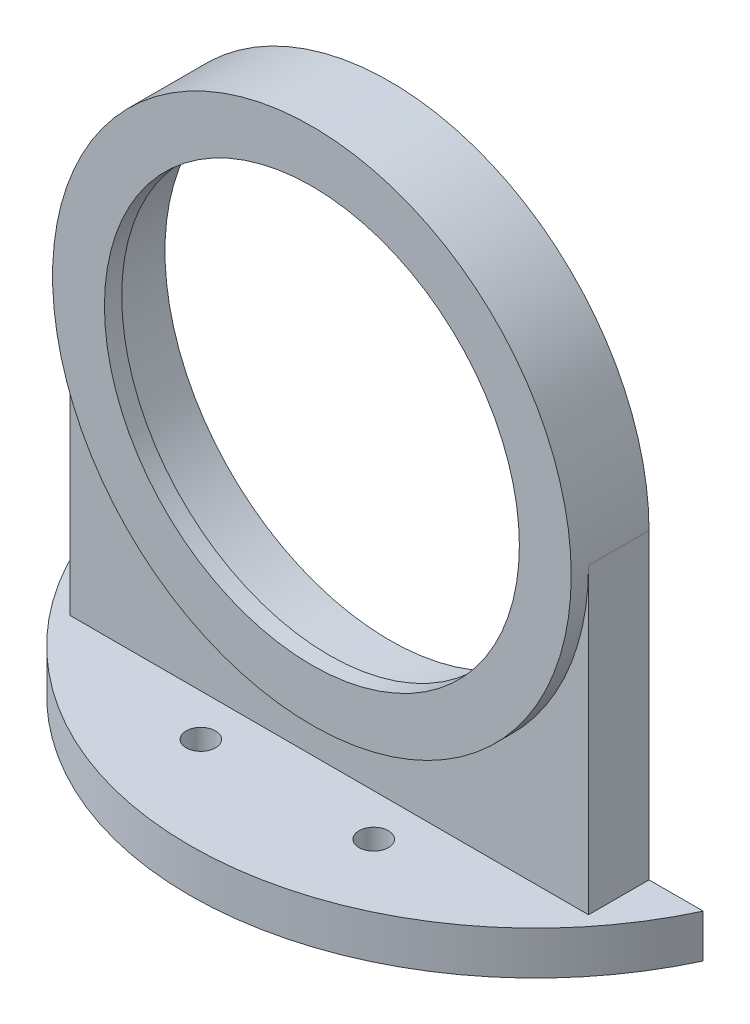
ISO-10303-21;
HEADER;
FILE_DESCRIPTION(('STEP AP214'),'2;1');
FILE_NAME('part.step','',(''),(''),'','','');
FILE_SCHEMA(('AUTOMOTIVE_DESIGN { 1 0 10303 214 1 1 1 1 }'));
ENDSEC;
DATA;
#1=APPLICATION_CONTEXT('core data for automotive mechanical design processes');
#2=APPLICATION_PROTOCOL_DEFINITION('international standard','automotive_design',2000,#1);
#3=PRODUCT_CONTEXT('',#1,'mechanical');
#4=PRODUCT('Part','Part','',(#3));
#5=PRODUCT_RELATED_PRODUCT_CATEGORY('part','',(#4));
#6=PRODUCT_DEFINITION_FORMATION('','',#4);
#7=PRODUCT_DEFINITION_CONTEXT('part definition',#1,'design');
#8=PRODUCT_DEFINITION('design','',#6,#7);
#9=PRODUCT_DEFINITION_SHAPE('','',#8);
#10=(LENGTH_UNIT() NAMED_UNIT(*) SI_UNIT(.MILLI.,.METRE.));
#11=(NAMED_UNIT(*) PLANE_ANGLE_UNIT() SI_UNIT($,.RADIAN.));
#12=(NAMED_UNIT(*) SI_UNIT($,.STERADIAN.) SOLID_ANGLE_UNIT());
#13=UNCERTAINTY_MEASURE_WITH_UNIT(LENGTH_MEASURE(1.E-05),#10,'distance_accuracy_value','');
#14=(GEOMETRIC_REPRESENTATION_CONTEXT(3) GLOBAL_UNCERTAINTY_ASSIGNED_CONTEXT((#13)) GLOBAL_UNIT_ASSIGNED_CONTEXT((#10,
#11,#12)) REPRESENTATION_CONTEXT('',''));
#15=CARTESIAN_POINT('',(0.,0.,0.));
#16=DIRECTION('',(0.,0.,1.));
#17=DIRECTION('',(1.,0.,0.));
#18=AXIS2_PLACEMENT_3D('',#15,#16,#17);
#19=CARTESIAN_POINT('',(0.,-33.,-16.88));
#20=DIRECTION('',(0.,-1.,0.));
#21=DIRECTION('',(0.,0.,-1.));
#22=AXIS2_PLACEMENT_3D('',#19,#20,#21);
#23=CYLINDRICAL_SURFACE('',#22,40.);
#24=DIRECTION('',(0.,-1.,0.));
#25=VECTOR('',#24,1.);
#26=CARTESIAN_POINT('',(36.2638332226476,-33.,0.));
#27=LINE('',#26,#25);
#28=CARTESIAN_POINT('',(36.2638332226476,-35.,0.));
#29=VERTEX_POINT('',#28);
#30=CARTESIAN_POINT('',(36.2638332226476,-40.,0.));
#31=VERTEX_POINT('',#30);
#32=EDGE_CURVE('E153',#29,#31,#27,.T.);
#33=ORIENTED_EDGE('',*,*,#32,.F.);
#34=CARTESIAN_POINT('',(0.,-35.,-16.88));
#35=DIRECTION('',(0.,1.,0.));
#36=DIRECTION('',(0.,0.,1.));
#37=AXIS2_PLACEMENT_3D('',#34,#35,#36);
#38=CIRCLE('',#37,40.);
#39=CARTESIAN_POINT('',(-36.2638332226476,-35.,0.));
#40=VERTEX_POINT('',#39);
#41=EDGE_CURVE('E122',#40,#29,#38,.T.);
#42=ORIENTED_EDGE('',*,*,#41,.F.);
#43=DIRECTION('',(0.,-1.,0.));
#44=VECTOR('',#43,1.);
#45=CARTESIAN_POINT('',(-36.2638332226476,-33.,0.));
#46=LINE('',#45,#44);
#47=CARTESIAN_POINT('',(-36.2638332226476,-40.,0.));
#48=VERTEX_POINT('',#47);
#49=EDGE_CURVE('E152',#40,#48,#46,.T.);
#50=ORIENTED_EDGE('',*,*,#49,.T.);
#51=CARTESIAN_POINT('',(0.,-40.,-16.88));
#52=DIRECTION('',(0.,-1.,0.));
#53=DIRECTION('',(0.,0.,-1.));
#54=AXIS2_PLACEMENT_3D('',#51,#52,#53);
#55=CIRCLE('',#54,40.);
#56=EDGE_CURVE('E125',#31,#48,#55,.T.);
#57=ORIENTED_EDGE('',*,*,#56,.F.);
#58=EDGE_LOOP('',(#33,#42,#50,#57));
#59=FACE_BOUND('',#58,.T.);
#60=ADVANCED_FACE('F41',(#59),#23,.T.);
#61=CARTESIAN_POINT('',(0.,0.,7.));
#62=DIRECTION('',(0.,0.,1.));
#63=DIRECTION('',(1.,0.,0.));
#64=AXIS2_PLACEMENT_3D('',#61,#62,#63);
#65=PLANE('',#64);
#66=DIRECTION('',(0.,1.,0.));
#67=VECTOR('',#66,1.);
#68=CARTESIAN_POINT('',(-30.,-33.,7.));
#69=LINE('',#68,#67);
#70=CARTESIAN_POINT('',(-30.,-35.,7.));
#71=VERTEX_POINT('',#70);
#72=CARTESIAN_POINT('',(-30.,-2.08166817117217E-13,7.));
#73=VERTEX_POINT('',#72);
#74=EDGE_CURVE('E103',#71,#73,#69,.T.);
#75=ORIENTED_EDGE('',*,*,#74,.F.);
#76=DIRECTION('',(-1.,0.,0.));
#77=VECTOR('',#76,1.);
#78=CARTESIAN_POINT('',(30.,-35.,7.));
#79=LINE('',#78,#77);
#80=CARTESIAN_POINT('',(30.,-35.,7.));
#81=VERTEX_POINT('',#80);
#82=EDGE_CURVE('E100',#81,#71,#79,.T.);
#83=ORIENTED_EDGE('',*,*,#82,.F.);
#84=DIRECTION('',(0.,-1.,0.));
#85=VECTOR('',#84,1.);
#86=CARTESIAN_POINT('',(30.,-33.,7.));
#87=LINE('',#86,#85);
#88=CARTESIAN_POINT('',(30.,-2.09488880330588E-13,7.));
#89=VERTEX_POINT('',#88);
#90=EDGE_CURVE('E89',#89,#81,#87,.T.);
#91=ORIENTED_EDGE('',*,*,#90,.F.);
#92=CARTESIAN_POINT('',(0.,0.,7.));
#93=DIRECTION('',(0.,0.,1.));
#94=DIRECTION('',(1.,0.,0.));
#95=AXIS2_PLACEMENT_3D('',#92,#93,#94);
#96=CIRCLE('',#95,30.);
#97=EDGE_CURVE('E142',#73,#89,#96,.T.);
#98=ORIENTED_EDGE('',*,*,#97,.F.);
#99=EDGE_LOOP('',(#75,#83,#91,#98));
#100=FACE_BOUND('',#99,.T.);
#101=ADVANCED_FACE('F101',(#100),#65,.T.);
#102=CARTESIAN_POINT('',(0.,0.,0.));
#103=DIRECTION('',(0.,0.,1.));
#104=DIRECTION('',(1.,0.,0.));
#105=AXIS2_PLACEMENT_3D('',#102,#103,#104);
#106=PLANE('',#105);
#107=DIRECTION('',(0.,-1.,0.));
#108=VECTOR('',#107,1.);
#109=CARTESIAN_POINT('',(30.,-33.,0.));
#110=LINE('',#109,#108);
#111=CARTESIAN_POINT('',(30.,-2.05814939933146E-13,0.));
#112=VERTEX_POINT('',#111);
#113=CARTESIAN_POINT('',(30.,-35.,0.));
#114=VERTEX_POINT('',#113);
#115=EDGE_CURVE('E56',#112,#114,#110,.T.);
#116=ORIENTED_EDGE('',*,*,#115,.T.);
#117=DIRECTION('',(-1.,0.,0.));
#118=VECTOR('',#117,1.);
#119=CARTESIAN_POINT('',(36.2638332226476,-35.,0.));
#120=LINE('',#119,#118);
#121=EDGE_CURVE('E111',#29,#114,#120,.T.);
#122=ORIENTED_EDGE('',*,*,#121,.F.);
#123=ORIENTED_EDGE('',*,*,#32,.T.);
#124=DIRECTION('',(1.,0.,0.));
#125=VECTOR('',#124,1.);
#126=CARTESIAN_POINT('',(-36.2638332226476,-40.,0.));
#127=LINE('',#126,#125);
#128=EDGE_CURVE('E128',#48,#31,#127,.T.);
#129=ORIENTED_EDGE('',*,*,#128,.F.);
#130=ORIENTED_EDGE('',*,*,#49,.F.);
#131=DIRECTION('',(-1.,0.,0.));
#132=VECTOR('',#131,1.);
#133=CARTESIAN_POINT('',(-30.,-35.,0.));
#134=LINE('',#133,#132);
#135=CARTESIAN_POINT('',(-30.,-35.,0.));
#136=VERTEX_POINT('',#135);
#137=EDGE_CURVE('E120',#136,#40,#134,.T.);
#138=ORIENTED_EDGE('',*,*,#137,.F.);
#139=DIRECTION('',(0.,1.,0.));
#140=VECTOR('',#139,1.);
#141=CARTESIAN_POINT('',(-30.,-33.,0.));
#142=LINE('',#141,#140);
#143=CARTESIAN_POINT('',(-30.,-2.09488880330588E-13,0.));
#144=VERTEX_POINT('',#143);
#145=EDGE_CURVE('E131',#136,#144,#142,.T.);
#146=ORIENTED_EDGE('',*,*,#145,.T.);
#147=CARTESIAN_POINT('',(0.,0.,0.));
#148=DIRECTION('',(0.,0.,1.));
#149=DIRECTION('',(1.,0.,0.));
#150=AXIS2_PLACEMENT_3D('',#147,#148,#149);
#151=CIRCLE('',#150,30.);
#152=EDGE_CURVE('E11',#112,#144,#151,.T.);
#153=ORIENTED_EDGE('',*,*,#152,.F.);
#154=EDGE_LOOP('',(#116,#122,#123,#129,#130,#138,#146,#153));
#155=FACE_BOUND('',#154,.T.);
#156=CARTESIAN_POINT('',(0.,0.,0.));
#157=DIRECTION('',(0.,0.,1.));
#158=DIRECTION('',(1.,0.,0.));
#159=AXIS2_PLACEMENT_3D('',#156,#157,#158);
#160=CIRCLE('',#159,26.);
#161=CARTESIAN_POINT('',(26.,0.,0.));
#162=VERTEX_POINT('',#161);
#163=EDGE_CURVE('E50',#162,#162,#160,.T.);
#164=ORIENTED_EDGE('',*,*,#163,.T.);
#165=EDGE_LOOP('',(#164));
#166=FACE_BOUND('',#165,.T.);
#167=ADVANCED_FACE('F158',(#155,#166),#106,.F.);
#168=CARTESIAN_POINT('',(0.,0.,7.));
#169=DIRECTION('',(0.,0.,-1.));
#170=DIRECTION('',(-1.,0.,0.));
#171=AXIS2_PLACEMENT_3D('',#168,#169,#170);
#172=CYLINDRICAL_SURFACE('',#171,30.);
#173=DIRECTION('',(0.,0.,-1.));
#174=VECTOR('',#173,1.);
#175=CARTESIAN_POINT('',(-30.,-2.09488880330588E-13,43.0451106254369));
#176=LINE('',#175,#174);
#177=EDGE_CURVE('E135',#73,#144,#176,.T.);
#178=ORIENTED_EDGE('',*,*,#177,.F.);
#179=ORIENTED_EDGE('',*,*,#97,.T.);
#180=DIRECTION('',(0.,0.,-1.));
#181=VECTOR('',#180,1.);
#182=CARTESIAN_POINT('',(30.,-2.05814939933146E-13,43.0451106254369));
#183=LINE('',#182,#181);
#184=EDGE_CURVE('E95',#89,#112,#183,.T.);
#185=ORIENTED_EDGE('',*,*,#184,.T.);
#186=ORIENTED_EDGE('',*,*,#152,.T.);
#187=EDGE_LOOP('',(#178,#179,#185,#186));
#188=FACE_BOUND('',#187,.T.);
#189=CARTESIAN_POINT('',(0.,0.,9.));
#190=DIRECTION('',(0.,0.,1.));
#191=DIRECTION('',(1.,0.,0.));
#192=AXIS2_PLACEMENT_3D('',#189,#190,#191);
#193=CIRCLE('',#192,30.);
#194=CARTESIAN_POINT('',(30.,0.,9.));
#195=VERTEX_POINT('',#194);
#196=EDGE_CURVE('E145',#195,#195,#193,.T.);
#197=ORIENTED_EDGE('',*,*,#196,.F.);
#198=EDGE_LOOP('',(#197));
#199=FACE_BOUND('',#198,.T.);
#200=ADVANCED_FACE('F43',(#188,#199),#172,.T.);
#201=CARTESIAN_POINT('',(0.,0.,7.));
#202=DIRECTION('',(0.,0.,-1.));
#203=DIRECTION('',(-1.,0.,0.));
#204=AXIS2_PLACEMENT_3D('',#201,#202,#203);
#205=CYLINDRICAL_SURFACE('',#204,26.);
#206=CARTESIAN_POINT('',(0.,0.,7.));
#207=DIRECTION('',(0.,0.,1.));
#208=DIRECTION('',(1.,0.,0.));
#209=AXIS2_PLACEMENT_3D('',#206,#207,#208);
#210=CIRCLE('',#209,26.);
#211=CARTESIAN_POINT('',(26.,0.,7.));
#212=VERTEX_POINT('',#211);
#213=EDGE_CURVE('E148',#212,#212,#210,.T.);
#214=ORIENTED_EDGE('',*,*,#213,.T.);
#215=EDGE_LOOP('',(#214));
#216=FACE_BOUND('',#215,.T.);
#217=ORIENTED_EDGE('',*,*,#163,.F.);
#218=EDGE_LOOP('',(#217));
#219=FACE_BOUND('',#218,.T.);
#220=ADVANCED_FACE('F160',(#216,#219),#205,.F.);
#221=CARTESIAN_POINT('',(0.,0.,7.));
#222=DIRECTION('',(0.,0.,1.));
#223=DIRECTION('',(1.,0.,0.));
#224=AXIS2_PLACEMENT_3D('',#221,#222,#223);
#225=PLANE('',#224);
#226=CARTESIAN_POINT('',(0.,0.,7.));
#227=DIRECTION('',(0.,0.,1.));
#228=DIRECTION('',(1.,0.,0.));
#229=AXIS2_PLACEMENT_3D('',#226,#227,#228);
#230=CIRCLE('',#229,24.);
#231=CARTESIAN_POINT('',(24.,0.,7.));
#232=VERTEX_POINT('',#231);
#233=EDGE_CURVE('E97',#232,#232,#230,.T.);
#234=ORIENTED_EDGE('',*,*,#233,.T.);
#235=EDGE_LOOP('',(#234));
#236=FACE_BOUND('',#235,.T.);
#237=ORIENTED_EDGE('',*,*,#213,.F.);
#238=EDGE_LOOP('',(#237));
#239=FACE_BOUND('',#238,.T.);
#240=ADVANCED_FACE('F162',(#236,#239),#225,.F.);
#241=CARTESIAN_POINT('',(0.,0.,9.));
#242=DIRECTION('',(0.,0.,1.));
#243=DIRECTION('',(1.,0.,0.));
#244=AXIS2_PLACEMENT_3D('',#241,#242,#243);
#245=PLANE('',#244);
#246=ORIENTED_EDGE('',*,*,#196,.T.);
#247=EDGE_LOOP('',(#246));
#248=FACE_BOUND('',#247,.T.);
#249=CARTESIAN_POINT('',(0.,0.,9.));
#250=DIRECTION('',(0.,0.,1.));
#251=DIRECTION('',(1.,0.,0.));
#252=AXIS2_PLACEMENT_3D('',#249,#250,#251);
#253=CIRCLE('',#252,24.);
#254=CARTESIAN_POINT('',(24.,0.,9.));
#255=VERTEX_POINT('',#254);
#256=EDGE_CURVE('E139',#255,#255,#253,.T.);
#257=ORIENTED_EDGE('',*,*,#256,.F.);
#258=EDGE_LOOP('',(#257));
#259=FACE_BOUND('',#258,.T.);
#260=ADVANCED_FACE('F169',(#248,#259),#245,.T.);
#261=CARTESIAN_POINT('',(0.,0.,9.));
#262=DIRECTION('',(0.,0.,-1.));
#263=DIRECTION('',(-1.,0.,0.));
#264=AXIS2_PLACEMENT_3D('',#261,#262,#263);
#265=CYLINDRICAL_SURFACE('',#264,24.);
#266=ORIENTED_EDGE('',*,*,#256,.T.);
#267=EDGE_LOOP('',(#266));
#268=FACE_BOUND('',#267,.T.);
#269=ORIENTED_EDGE('',*,*,#233,.F.);
#270=EDGE_LOOP('',(#269));
#271=FACE_BOUND('',#270,.T.);
#272=ADVANCED_FACE('F186',(#268,#271),#265,.F.);
#273=CARTESIAN_POINT('',(30.,-33.,43.0451106254369));
#274=DIRECTION('',(1.,0.,0.));
#275=DIRECTION('',(0.,0.,-1.));
#276=AXIS2_PLACEMENT_3D('',#273,#274,#275);
#277=PLANE('',#276);
#278=ORIENTED_EDGE('',*,*,#184,.F.);
#279=ORIENTED_EDGE('',*,*,#90,.T.);
#280=DIRECTION('',(0.,0.,1.));
#281=VECTOR('',#280,1.);
#282=CARTESIAN_POINT('',(30.,-35.,0.));
#283=LINE('',#282,#281);
#284=EDGE_CURVE('E93',#114,#81,#283,.T.);
#285=ORIENTED_EDGE('',*,*,#284,.F.);
#286=ORIENTED_EDGE('',*,*,#115,.F.);
#287=EDGE_LOOP('',(#278,#279,#285,#286));
#288=FACE_BOUND('',#287,.T.);
#289=ADVANCED_FACE('F91',(#288),#277,.T.);
#290=CARTESIAN_POINT('',(-30.,-33.,43.0451106254369));
#291=DIRECTION('',(-1.,0.,0.));
#292=DIRECTION('',(0.,0.,1.));
#293=AXIS2_PLACEMENT_3D('',#290,#291,#292);
#294=PLANE('',#293);
#295=ORIENTED_EDGE('',*,*,#145,.F.);
#296=DIRECTION('',(0.,0.,-1.));
#297=VECTOR('',#296,1.);
#298=CARTESIAN_POINT('',(-30.,-35.,7.));
#299=LINE('',#298,#297);
#300=EDGE_CURVE('E107',#71,#136,#299,.T.);
#301=ORIENTED_EDGE('',*,*,#300,.F.);
#302=ORIENTED_EDGE('',*,*,#74,.T.);
#303=ORIENTED_EDGE('',*,*,#177,.T.);
#304=EDGE_LOOP('',(#295,#301,#302,#303));
#305=FACE_BOUND('',#304,.T.);
#306=ADVANCED_FACE('F192',(#305),#294,.T.);
#307=CARTESIAN_POINT('',(0.,-40.,-16.88));
#308=DIRECTION('',(0.,-1.,0.));
#309=DIRECTION('',(0.,0.,-1.));
#310=AXIS2_PLACEMENT_3D('',#307,#308,#309);
#311=PLANE('',#310);
#312=CARTESIAN_POINT('',(-10.,-40.,11.85));
#313=DIRECTION('',(0.,-1.,0.));
#314=DIRECTION('',(0.,0.,-1.));
#315=AXIS2_PLACEMENT_3D('',#312,#313,#314);
#316=CIRCLE('',#315,1.7);
#317=CARTESIAN_POINT('',(-10.,-40.,10.15));
#318=VERTEX_POINT('',#317);
#319=EDGE_CURVE('E112',#318,#318,#316,.T.);
#320=ORIENTED_EDGE('',*,*,#319,.F.);
#321=EDGE_LOOP('',(#320));
#322=FACE_BOUND('',#321,.T.);
#323=CARTESIAN_POINT('',(10.,-40.,11.85));
#324=DIRECTION('',(0.,-1.,0.));
#325=DIRECTION('',(0.,0.,-1.));
#326=AXIS2_PLACEMENT_3D('',#323,#324,#325);
#327=CIRCLE('',#326,1.7);
#328=CARTESIAN_POINT('',(10.,-40.,10.15));
#329=VERTEX_POINT('',#328);
#330=EDGE_CURVE('E115',#329,#329,#327,.T.);
#331=ORIENTED_EDGE('',*,*,#330,.F.);
#332=EDGE_LOOP('',(#331));
#333=FACE_BOUND('',#332,.T.);
#334=ORIENTED_EDGE('',*,*,#56,.T.);
#335=ORIENTED_EDGE('',*,*,#128,.T.);
#336=EDGE_LOOP('',(#334,#335));
#337=FACE_BOUND('',#336,.T.);
#338=ADVANCED_FACE('F195',(#322,#333,#337),#311,.T.);
#339=CARTESIAN_POINT('',(0.,-35.,-16.88));
#340=DIRECTION('',(0.,1.,0.));
#341=DIRECTION('',(0.,0.,1.));
#342=AXIS2_PLACEMENT_3D('',#339,#340,#341);
#343=PLANE('',#342);
#344=CARTESIAN_POINT('',(-10.,-35.,11.85));
#345=DIRECTION('',(0.,1.,0.));
#346=DIRECTION('',(0.,0.,1.));
#347=AXIS2_PLACEMENT_3D('',#344,#345,#346);
#348=CIRCLE('',#347,1.7);
#349=CARTESIAN_POINT('',(-10.,-35.,13.55));
#350=VERTEX_POINT('',#349);
#351=EDGE_CURVE('E216',#350,#350,#348,.T.);
#352=ORIENTED_EDGE('',*,*,#351,.F.);
#353=EDGE_LOOP('',(#352));
#354=FACE_BOUND('',#353,.T.);
#355=CARTESIAN_POINT('',(10.,-35.,11.85));
#356=DIRECTION('',(0.,1.,0.));
#357=DIRECTION('',(0.,0.,-1.));
#358=AXIS2_PLACEMENT_3D('',#355,#356,#357);
#359=CIRCLE('',#358,1.7);
#360=CARTESIAN_POINT('',(10.,-35.,10.15));
#361=VERTEX_POINT('',#360);
#362=EDGE_CURVE('E217',#361,#361,#359,.T.);
#363=ORIENTED_EDGE('',*,*,#362,.F.);
#364=EDGE_LOOP('',(#363));
#365=FACE_BOUND('',#364,.T.);
#366=ORIENTED_EDGE('',*,*,#284,.T.);
#367=ORIENTED_EDGE('',*,*,#82,.T.);
#368=ORIENTED_EDGE('',*,*,#300,.T.);
#369=ORIENTED_EDGE('',*,*,#137,.T.);
#370=ORIENTED_EDGE('',*,*,#41,.T.);
#371=ORIENTED_EDGE('',*,*,#121,.T.);
#372=EDGE_LOOP('',(#366,#367,#368,#369,#370,#371));
#373=FACE_BOUND('',#372,.T.);
#374=ADVANCED_FACE('F109',(#354,#365,#373),#343,.T.);
#375=CARTESIAN_POINT('',(10.,-45.,11.85));
#376=DIRECTION('',(0.,1.,0.));
#377=DIRECTION('',(0.,0.,1.));
#378=AXIS2_PLACEMENT_3D('',#375,#376,#377);
#379=CYLINDRICAL_SURFACE('',#378,1.7);
#380=ORIENTED_EDGE('',*,*,#330,.T.);
#381=EDGE_LOOP('',(#380));
#382=FACE_BOUND('',#381,.T.);
#383=ORIENTED_EDGE('',*,*,#362,.T.);
#384=EDGE_LOOP('',(#383));
#385=FACE_BOUND('',#384,.T.);
#386=ADVANCED_FACE('F202',(#382,#385),#379,.F.);
#387=CARTESIAN_POINT('',(-10.,-45.,11.85));
#388=DIRECTION('',(0.,1.,0.));
#389=DIRECTION('',(0.,0.,1.));
#390=AXIS2_PLACEMENT_3D('',#387,#388,#389);
#391=CYLINDRICAL_SURFACE('',#390,1.7);
#392=ORIENTED_EDGE('',*,*,#319,.T.);
#393=EDGE_LOOP('',(#392));
#394=FACE_BOUND('',#393,.T.);
#395=ORIENTED_EDGE('',*,*,#351,.T.);
#396=EDGE_LOOP('',(#395));
#397=FACE_BOUND('',#396,.T.);
#398=ADVANCED_FACE('F206',(#394,#397),#391,.F.);
#399=CLOSED_SHELL('',(#60,#101,#167,#200,#220,#240,#260,#272,#289,#306,#338,#374,#386,#398));
#400=MANIFOLD_SOLID_BREP('B2',#399);
#401=ADVANCED_BREP_SHAPE_REPRESENTATION('',(#18,#400),#14);
#402=SHAPE_DEFINITION_REPRESENTATION(#9,#401);
ENDSEC;
END-ISO-10303-21;
